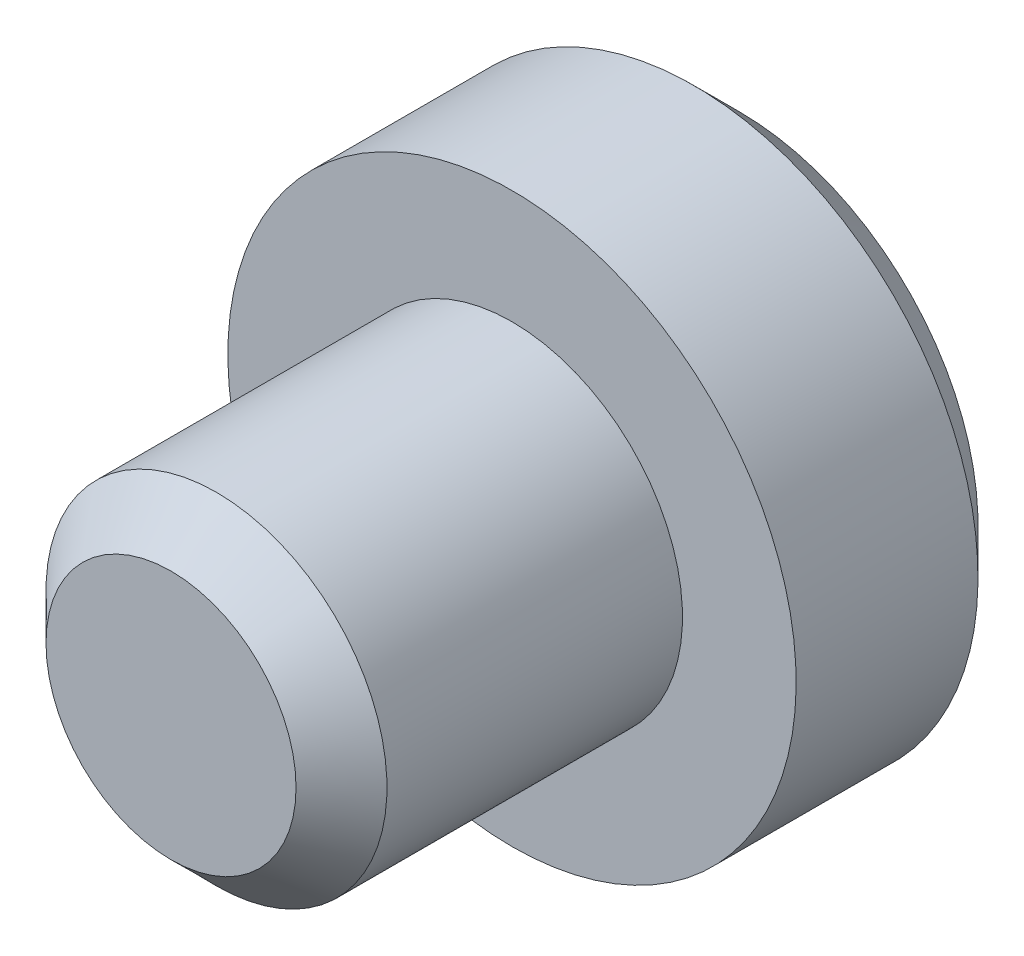
ISO-10303-21;
HEADER;
FILE_DESCRIPTION(('STEP AP214'),'2;1');
FILE_NAME('part.step','',(''),(''),'','','');
FILE_SCHEMA(('AUTOMOTIVE_DESIGN { 1 0 10303 214 1 1 1 1 }'));
ENDSEC;
DATA;
#1=APPLICATION_CONTEXT('core data for automotive mechanical design processes');
#2=APPLICATION_PROTOCOL_DEFINITION('international standard','automotive_design',2000,#1);
#3=PRODUCT_CONTEXT('',#1,'mechanical');
#4=PRODUCT('Part','Part','',(#3));
#5=PRODUCT_RELATED_PRODUCT_CATEGORY('part','',(#4));
#6=PRODUCT_DEFINITION_FORMATION('','',#4);
#7=PRODUCT_DEFINITION_CONTEXT('part definition',#1,'design');
#8=PRODUCT_DEFINITION('design','',#6,#7);
#9=PRODUCT_DEFINITION_SHAPE('','',#8);
#10=(LENGTH_UNIT() NAMED_UNIT(*) SI_UNIT(.MILLI.,.METRE.));
#11=(NAMED_UNIT(*) PLANE_ANGLE_UNIT() SI_UNIT($,.RADIAN.));
#12=(NAMED_UNIT(*) SI_UNIT($,.STERADIAN.) SOLID_ANGLE_UNIT());
#13=UNCERTAINTY_MEASURE_WITH_UNIT(LENGTH_MEASURE(1.E-05),#10,'distance_accuracy_value','');
#14=(GEOMETRIC_REPRESENTATION_CONTEXT(3) GLOBAL_UNCERTAINTY_ASSIGNED_CONTEXT((#13)) GLOBAL_UNIT_ASSIGNED_CONTEXT((#10,
#11,#12)) REPRESENTATION_CONTEXT('',''));
#15=CARTESIAN_POINT('',(0.,0.,0.));
#16=DIRECTION('',(0.,0.,1.));
#17=DIRECTION('',(1.,0.,0.));
#18=AXIS2_PLACEMENT_3D('',#15,#16,#17);
#19=CARTESIAN_POINT('',(0.,0.,0.));
#20=DIRECTION('',(0.,0.,1.));
#21=DIRECTION('',(0.,-1.,0.));
#22=AXIS2_PLACEMENT_3D('',#19,#20,#21);
#23=PLANE('',#22);
#24=DIRECTION('',(0.799545155725772,-0.600605980619117,0.));
#25=VECTOR('',#24,1.);
#26=CARTESIAN_POINT('',(-0.720727176742942,-0.959454186870927,0.));
#27=LINE('',#26,#25);
#28=CARTESIAN_POINT('',(-1.27466830980798,-0.543342157366111,0.));
#29=VERTEX_POINT('',#28);
#30=CARTESIAN_POINT('',(-0.166786043677898,-1.37556621637574,0.));
#31=VERTEX_POINT('',#30);
#32=EDGE_CURVE('E165',#29,#31,#27,.T.);
#33=ORIENTED_EDGE('',*,*,#32,.T.);
#34=DIRECTION('',(0.919912614743906,0.392123426021745,0.));
#35=VECTOR('',#34,1.);
#36=CARTESIAN_POINT('',(0.470548111226095,-1.10389513769269,0.));
#37=LINE('',#36,#35);
#38=CARTESIAN_POINT('',(1.10788226613009,-0.832224059009633,0.));
#39=VERTEX_POINT('',#38);
#40=EDGE_CURVE('E175',#31,#39,#37,.T.);
#41=ORIENTED_EDGE('',*,*,#40,.T.);
#42=DIRECTION('',(0.120367459018134,0.992729406640862,0.));
#43=VECTOR('',#42,1.);
#44=CARTESIAN_POINT('',(1.19127528796904,-0.144440950821761,0.));
#45=LINE('',#44,#43);
#46=CARTESIAN_POINT('',(1.27466830980799,0.54334215736611,0.));
#47=VERTEX_POINT('',#46);
#48=EDGE_CURVE('E173',#39,#47,#45,.T.);
#49=ORIENTED_EDGE('',*,*,#48,.T.);
#50=DIRECTION('',(-0.799545155725772,0.600605980619117,0.));
#51=VECTOR('',#50,1.);
#52=CARTESIAN_POINT('',(0.720727176742942,0.959454186870927,0.));
#53=LINE('',#52,#51);
#54=CARTESIAN_POINT('',(0.166786043677898,1.37556621637574,0.));
#55=VERTEX_POINT('',#54);
#56=EDGE_CURVE('E171',#47,#55,#53,.T.);
#57=ORIENTED_EDGE('',*,*,#56,.T.);
#58=DIRECTION('',(-0.919912614743906,-0.392123426021745,0.));
#59=VECTOR('',#58,1.);
#60=CARTESIAN_POINT('',(-0.470548111226095,1.10389513769269,0.));
#61=LINE('',#60,#59);
#62=CARTESIAN_POINT('',(-1.10788226613009,0.832224059009633,0.));
#63=VERTEX_POINT('',#62);
#64=EDGE_CURVE('E169',#55,#63,#61,.T.);
#65=ORIENTED_EDGE('',*,*,#64,.T.);
#66=DIRECTION('',(-0.120367459018134,-0.992729406640862,0.));
#67=VECTOR('',#66,1.);
#68=CARTESIAN_POINT('',(-1.19127528796903,0.144440950821761,0.));
#69=LINE('',#68,#67);
#70=EDGE_CURVE('E167',#63,#29,#69,.T.);
#71=ORIENTED_EDGE('',*,*,#70,.T.);
#72=EDGE_LOOP('',(#33,#41,#49,#57,#65,#71));
#73=FACE_BOUND('',#72,.T.);
#74=CARTESIAN_POINT('',(0.,0.,0.));
#75=DIRECTION('',(0.,0.,1.));
#76=DIRECTION('',(0.,-1.,0.));
#77=AXIS2_PLACEMENT_3D('',#74,#75,#76);
#78=CIRCLE('',#77,2.1);
#79=CARTESIAN_POINT('',(0.,-2.1,0.));
#80=VERTEX_POINT('',#79);
#81=EDGE_CURVE('E159',#80,#80,#78,.F.);
#82=ORIENTED_EDGE('',*,*,#81,.T.);
#83=EDGE_LOOP('',(#82));
#84=FACE_BOUND('',#83,.T.);
#85=ADVANCED_FACE('F32',(#73,#84),#23,.F.);
#86=CARTESIAN_POINT('',(0.,0.,5.));
#87=DIRECTION('',(0.,0.,1.));
#88=DIRECTION('',(0.,-1.,0.));
#89=AXIS2_PLACEMENT_3D('',#86,#87,#88);
#90=CYLINDRICAL_SURFACE('',#89,2.5);
#91=CARTESIAN_POINT('',(0.,0.,0.399999999999998));
#92=DIRECTION('',(0.,0.,1.));
#93=DIRECTION('',(0.,-1.,0.));
#94=AXIS2_PLACEMENT_3D('',#91,#92,#93);
#95=CIRCLE('',#94,2.5);
#96=CARTESIAN_POINT('',(0.,-2.5,0.399999999999998));
#97=VERTEX_POINT('',#96);
#98=EDGE_CURVE('E156',#97,#97,#95,.T.);
#99=ORIENTED_EDGE('',*,*,#98,.T.);
#100=EDGE_LOOP('',(#99));
#101=FACE_BOUND('',#100,.T.);
#102=CARTESIAN_POINT('',(0.,0.,2.));
#103=DIRECTION('',(0.,0.,1.));
#104=DIRECTION('',(0.,-1.,0.));
#105=AXIS2_PLACEMENT_3D('',#102,#103,#104);
#106=CIRCLE('',#105,2.5);
#107=CARTESIAN_POINT('',(0.,-2.5,2.));
#108=VERTEX_POINT('',#107);
#109=EDGE_CURVE('E147',#108,#108,#106,.T.);
#110=ORIENTED_EDGE('',*,*,#109,.F.);
#111=EDGE_LOOP('',(#110));
#112=FACE_BOUND('',#111,.T.);
#113=ADVANCED_FACE('F243',(#101,#112),#90,.T.);
#114=CARTESIAN_POINT('',(0.,2.5,2.));
#115=DIRECTION('',(0.,0.,-1.));
#116=DIRECTION('',(0.,1.,0.));
#117=AXIS2_PLACEMENT_3D('',#114,#115,#116);
#118=PLANE('',#117);
#119=CARTESIAN_POINT('',(0.,0.,2.));
#120=DIRECTION('',(0.,0.,1.));
#121=DIRECTION('',(0.,-1.,0.));
#122=AXIS2_PLACEMENT_3D('',#119,#120,#121);
#123=CIRCLE('',#122,1.5);
#124=CARTESIAN_POINT('',(0.,-1.5,2.));
#125=VERTEX_POINT('',#124);
#126=EDGE_CURVE('E134',#125,#125,#123,.T.);
#127=ORIENTED_EDGE('',*,*,#126,.F.);
#128=EDGE_LOOP('',(#127));
#129=FACE_BOUND('',#128,.T.);
#130=ORIENTED_EDGE('',*,*,#109,.T.);
#131=EDGE_LOOP('',(#130));
#132=FACE_BOUND('',#131,.T.);
#133=ADVANCED_FACE('F248',(#129,#132),#118,.F.);
#134=CARTESIAN_POINT('',(0.,0.,5.));
#135=DIRECTION('',(0.,0.,1.));
#136=DIRECTION('',(0.,-1.,0.));
#137=AXIS2_PLACEMENT_3D('',#134,#135,#136);
#138=CYLINDRICAL_SURFACE('',#137,1.5);
#139=CARTESIAN_POINT('',(0.,0.,4.6));
#140=DIRECTION('',(0.,0.,-1.));
#141=DIRECTION('',(0.,1.,0.));
#142=AXIS2_PLACEMENT_3D('',#139,#140,#141);
#143=CIRCLE('',#142,1.5);
#144=CARTESIAN_POINT('',(0.,1.5,4.6));
#145=VERTEX_POINT('',#144);
#146=EDGE_CURVE('E153',#145,#145,#143,.T.);
#147=ORIENTED_EDGE('',*,*,#146,.T.);
#148=EDGE_LOOP('',(#147));
#149=FACE_BOUND('',#148,.T.);
#150=ORIENTED_EDGE('',*,*,#126,.T.);
#151=EDGE_LOOP('',(#150));
#152=FACE_BOUND('',#151,.T.);
#153=ADVANCED_FACE('F346',(#149,#152),#138,.T.);
#154=CARTESIAN_POINT('',(0.,1.5,5.));
#155=DIRECTION('',(0.,0.,-1.));
#156=DIRECTION('',(0.,1.,0.));
#157=AXIS2_PLACEMENT_3D('',#154,#155,#156);
#158=PLANE('',#157);
#159=CARTESIAN_POINT('',(0.,0.,5.));
#160=DIRECTION('',(0.,0.,-1.));
#161=DIRECTION('',(0.,1.,0.));
#162=AXIS2_PLACEMENT_3D('',#159,#160,#161);
#163=CIRCLE('',#162,1.1);
#164=CARTESIAN_POINT('',(0.,1.1,5.));
#165=VERTEX_POINT('',#164);
#166=EDGE_CURVE('E150',#165,#165,#163,.F.);
#167=ORIENTED_EDGE('',*,*,#166,.T.);
#168=EDGE_LOOP('',(#167));
#169=FACE_BOUND('',#168,.T.);
#170=ADVANCED_FACE('F325',(#169),#158,.F.);
#171=CARTESIAN_POINT('',(-0.152887206704739,-1.26093569834443,2.));
#172=DIRECTION('',(-0.600605980619117,-0.799545155725772,0.));
#173=DIRECTION('',(0.799545155725772,-0.600605980619117,0.));
#174=AXIS2_PLACEMENT_3D('',#171,#172,#173);
#175=PLANE('',#174);
#176=DIRECTION('',(0.,0.,-1.));
#177=VECTOR('',#176,1.);
#178=CARTESIAN_POINT('',(-0.152887206704739,-1.26093569834443,2.));
#179=LINE('',#178,#177);
#180=CARTESIAN_POINT('',(-0.152887206704739,-1.26093569834443,2.));
#181=VERTEX_POINT('',#180);
#182=CARTESIAN_POINT('',(-0.152887206704739,-1.26093569834443,0.100000000000001));
#183=VERTEX_POINT('',#182);
#184=EDGE_CURVE('E132',#181,#183,#179,.T.);
#185=ORIENTED_EDGE('',*,*,#184,.T.);
#186=DIRECTION('',(-0.799545155725772,0.600605980619117,0.));
#187=VECTOR('',#186,1.);
#188=CARTESIAN_POINT('',(-0.152887206704739,-1.26093569834443,0.100000000000001));
#189=LINE('',#188,#187);
#190=CARTESIAN_POINT('',(-1.16844595065732,-0.498063644252268,0.100000000000001));
#191=VERTEX_POINT('',#190);
#192=EDGE_CURVE('E11',#183,#191,#189,.T.);
#193=ORIENTED_EDGE('',*,*,#192,.T.);
#194=DIRECTION('',(0.,0.,-1.));
#195=VECTOR('',#194,1.);
#196=CARTESIAN_POINT('',(-1.16844595065732,-0.498063644252268,2.));
#197=LINE('',#196,#195);
#198=CARTESIAN_POINT('',(-1.16844595065732,-0.498063644252268,2.));
#199=VERTEX_POINT('',#198);
#200=EDGE_CURVE('E101',#199,#191,#197,.T.);
#201=ORIENTED_EDGE('',*,*,#200,.F.);
#202=DIRECTION('',(-0.799545155725772,0.600605980619117,0.));
#203=VECTOR('',#202,1.);
#204=CARTESIAN_POINT('',(-0.152887206704739,-1.26093569834443,2.));
#205=LINE('',#204,#203);
#206=EDGE_CURVE('E105',#181,#199,#205,.T.);
#207=ORIENTED_EDGE('',*,*,#206,.F.);
#208=EDGE_LOOP('',(#185,#193,#201,#207));
#209=FACE_BOUND('',#208,.T.);
#210=ADVANCED_FACE('F103',(#209),#175,.F.);
#211=CARTESIAN_POINT('',(1.01555874395258,-0.762872054092163,2.));
#212=DIRECTION('',(0.392123426021745,-0.919912614743906,0.));
#213=DIRECTION('',(0.919912614743906,0.392123426021745,0.));
#214=AXIS2_PLACEMENT_3D('',#211,#212,#213);
#215=PLANE('',#214);
#216=DIRECTION('',(0.,0.,-1.));
#217=VECTOR('',#216,1.);
#218=CARTESIAN_POINT('',(1.01555874395258,-0.762872054092163,2.));
#219=LINE('',#218,#217);
#220=CARTESIAN_POINT('',(1.01555874395258,-0.762872054092163,2.));
#221=VERTEX_POINT('',#220);
#222=CARTESIAN_POINT('',(1.01555874395258,-0.762872054092163,0.100000000000001));
#223=VERTEX_POINT('',#222);
#224=EDGE_CURVE('E135',#221,#223,#219,.T.);
#225=ORIENTED_EDGE('',*,*,#224,.T.);
#226=DIRECTION('',(-0.919912614743906,-0.392123426021745,0.));
#227=VECTOR('',#226,1.);
#228=CARTESIAN_POINT('',(1.01555874395258,-0.762872054092163,0.100000000000001));
#229=LINE('',#228,#227);
#230=EDGE_CURVE('E162',#223,#183,#229,.T.);
#231=ORIENTED_EDGE('',*,*,#230,.T.);
#232=ORIENTED_EDGE('',*,*,#184,.F.);
#233=DIRECTION('',(-0.919912614743906,-0.392123426021745,0.));
#234=VECTOR('',#233,1.);
#235=CARTESIAN_POINT('',(1.01555874395258,-0.762872054092163,2.));
#236=LINE('',#235,#234);
#237=EDGE_CURVE('E108',#221,#181,#236,.T.);
#238=ORIENTED_EDGE('',*,*,#237,.F.);
#239=EDGE_LOOP('',(#225,#231,#232,#238));
#240=FACE_BOUND('',#239,.T.);
#241=ADVANCED_FACE('F213',(#240),#215,.F.);
#242=CARTESIAN_POINT('',(1.16844595065732,0.498063644252268,2.));
#243=DIRECTION('',(0.992729406640862,-0.120367459018134,0.));
#244=DIRECTION('',(0.120367459018134,0.992729406640862,0.));
#245=AXIS2_PLACEMENT_3D('',#242,#243,#244);
#246=PLANE('',#245);
#247=DIRECTION('',(0.,0.,-1.));
#248=VECTOR('',#247,1.);
#249=CARTESIAN_POINT('',(1.16844595065732,0.498063644252268,2.));
#250=LINE('',#249,#248);
#251=CARTESIAN_POINT('',(1.16844595065732,0.498063644252268,2.));
#252=VERTEX_POINT('',#251);
#253=CARTESIAN_POINT('',(1.16844595065732,0.498063644252268,0.100000000000001));
#254=VERTEX_POINT('',#253);
#255=EDGE_CURVE('E138',#252,#254,#250,.T.);
#256=ORIENTED_EDGE('',*,*,#255,.T.);
#257=DIRECTION('',(-0.120367459018134,-0.992729406640862,0.));
#258=VECTOR('',#257,1.);
#259=CARTESIAN_POINT('',(1.16844595065732,0.498063644252268,0.100000000000001));
#260=LINE('',#259,#258);
#261=EDGE_CURVE('E178',#254,#223,#260,.T.);
#262=ORIENTED_EDGE('',*,*,#261,.T.);
#263=ORIENTED_EDGE('',*,*,#224,.F.);
#264=DIRECTION('',(-0.120367459018134,-0.992729406640862,0.));
#265=VECTOR('',#264,1.);
#266=CARTESIAN_POINT('',(1.16844595065732,0.498063644252268,2.));
#267=LINE('',#266,#265);
#268=EDGE_CURVE('E129',#252,#221,#267,.T.);
#269=ORIENTED_EDGE('',*,*,#268,.F.);
#270=EDGE_LOOP('',(#256,#262,#263,#269));
#271=FACE_BOUND('',#270,.T.);
#272=ADVANCED_FACE('F233',(#271),#246,.F.);
#273=CARTESIAN_POINT('',(0.15288720670474,1.26093569834443,2.));
#274=DIRECTION('',(0.600605980619117,0.799545155725772,0.));
#275=DIRECTION('',(-0.799545155725772,0.600605980619117,0.));
#276=AXIS2_PLACEMENT_3D('',#273,#274,#275);
#277=PLANE('',#276);
#278=DIRECTION('',(0.,0.,-1.));
#279=VECTOR('',#278,1.);
#280=CARTESIAN_POINT('',(0.15288720670474,1.26093569834443,2.));
#281=LINE('',#280,#279);
#282=CARTESIAN_POINT('',(0.15288720670474,1.26093569834443,2.));
#283=VERTEX_POINT('',#282);
#284=CARTESIAN_POINT('',(0.15288720670474,1.26093569834443,0.100000000000001));
#285=VERTEX_POINT('',#284);
#286=EDGE_CURVE('E141',#283,#285,#281,.T.);
#287=ORIENTED_EDGE('',*,*,#286,.T.);
#288=DIRECTION('',(0.799545155725772,-0.600605980619117,0.));
#289=VECTOR('',#288,1.);
#290=CARTESIAN_POINT('',(0.15288720670474,1.26093569834443,0.100000000000001));
#291=LINE('',#290,#289);
#292=EDGE_CURVE('E180',#285,#254,#291,.T.);
#293=ORIENTED_EDGE('',*,*,#292,.T.);
#294=ORIENTED_EDGE('',*,*,#255,.F.);
#295=DIRECTION('',(0.799545155725772,-0.600605980619117,0.));
#296=VECTOR('',#295,1.);
#297=CARTESIAN_POINT('',(0.15288720670474,1.26093569834443,2.));
#298=LINE('',#297,#296);
#299=EDGE_CURVE('E126',#283,#252,#298,.T.);
#300=ORIENTED_EDGE('',*,*,#299,.F.);
#301=EDGE_LOOP('',(#287,#293,#294,#300));
#302=FACE_BOUND('',#301,.T.);
#303=ADVANCED_FACE('F209',(#302),#277,.F.);
#304=CARTESIAN_POINT('',(-1.01555874395258,0.762872054092163,2.));
#305=DIRECTION('',(-0.392123426021745,0.919912614743906,0.));
#306=DIRECTION('',(-0.919912614743906,-0.392123426021745,0.));
#307=AXIS2_PLACEMENT_3D('',#304,#305,#306);
#308=PLANE('',#307);
#309=DIRECTION('',(0.,0.,-1.));
#310=VECTOR('',#309,1.);
#311=CARTESIAN_POINT('',(-1.01555874395258,0.762872054092163,2.));
#312=LINE('',#311,#310);
#313=CARTESIAN_POINT('',(-1.01555874395258,0.762872054092163,2.));
#314=VERTEX_POINT('',#313);
#315=CARTESIAN_POINT('',(-1.01555874395258,0.762872054092163,0.100000000000001));
#316=VERTEX_POINT('',#315);
#317=EDGE_CURVE('E107',#314,#316,#312,.T.);
#318=ORIENTED_EDGE('',*,*,#317,.T.);
#319=DIRECTION('',(0.919912614743906,0.392123426021745,0.));
#320=VECTOR('',#319,1.);
#321=CARTESIAN_POINT('',(-1.01555874395258,0.762872054092163,0.100000000000001));
#322=LINE('',#321,#320);
#323=EDGE_CURVE('E182',#316,#285,#322,.T.);
#324=ORIENTED_EDGE('',*,*,#323,.T.);
#325=ORIENTED_EDGE('',*,*,#286,.F.);
#326=DIRECTION('',(0.919912614743906,0.392123426021745,0.));
#327=VECTOR('',#326,1.);
#328=CARTESIAN_POINT('',(-1.01555874395258,0.762872054092163,2.));
#329=LINE('',#328,#327);
#330=EDGE_CURVE('E116',#314,#283,#329,.T.);
#331=ORIENTED_EDGE('',*,*,#330,.F.);
#332=EDGE_LOOP('',(#318,#324,#325,#331));
#333=FACE_BOUND('',#332,.T.);
#334=ADVANCED_FACE('F206',(#333),#308,.F.);
#335=CARTESIAN_POINT('',(-1.16844595065732,-0.498063644252268,2.));
#336=DIRECTION('',(-0.992729406640862,0.120367459018134,0.));
#337=DIRECTION('',(-0.120367459018134,-0.992729406640862,0.));
#338=AXIS2_PLACEMENT_3D('',#335,#336,#337);
#339=PLANE('',#338);
#340=ORIENTED_EDGE('',*,*,#200,.T.);
#341=DIRECTION('',(0.120367459018134,0.992729406640862,0.));
#342=VECTOR('',#341,1.);
#343=CARTESIAN_POINT('',(-1.16844595065732,-0.498063644252268,0.100000000000001));
#344=LINE('',#343,#342);
#345=EDGE_CURVE('E41',#191,#316,#344,.T.);
#346=ORIENTED_EDGE('',*,*,#345,.T.);
#347=ORIENTED_EDGE('',*,*,#317,.F.);
#348=DIRECTION('',(0.120367459018134,0.992729406640862,0.));
#349=VECTOR('',#348,1.);
#350=CARTESIAN_POINT('',(-1.16844595065732,-0.498063644252268,2.));
#351=LINE('',#350,#349);
#352=EDGE_CURVE('E111',#199,#314,#351,.T.);
#353=ORIENTED_EDGE('',*,*,#352,.F.);
#354=EDGE_LOOP('',(#340,#346,#347,#353));
#355=FACE_BOUND('',#354,.T.);
#356=ADVANCED_FACE('F112',(#355),#339,.F.);
#357=CARTESIAN_POINT('',(0.,0.,2.));
#358=DIRECTION('',(0.,0.,-1.));
#359=DIRECTION('',(0.,1.,0.));
#360=AXIS2_PLACEMENT_3D('',#357,#358,#359);
#361=PLANE('',#360);
#362=ORIENTED_EDGE('',*,*,#206,.T.);
#363=ORIENTED_EDGE('',*,*,#352,.T.);
#364=ORIENTED_EDGE('',*,*,#330,.T.);
#365=ORIENTED_EDGE('',*,*,#299,.T.);
#366=ORIENTED_EDGE('',*,*,#268,.T.);
#367=ORIENTED_EDGE('',*,*,#237,.T.);
#368=EDGE_LOOP('',(#362,#363,#364,#365,#366,#367));
#369=FACE_BOUND('',#368,.T.);
#370=ADVANCED_FACE('F118',(#369),#361,.T.);
#371=CARTESIAN_POINT('',(0.,0.,5.));
#372=DIRECTION('',(0.,0.,-1.));
#373=DIRECTION('',(0.,1.,0.));
#374=AXIS2_PLACEMENT_3D('',#371,#372,#373);
#375=CONICAL_SURFACE('',#374,1.1,0.785398163397447);
#376=ORIENTED_EDGE('',*,*,#146,.F.);
#377=EDGE_LOOP('',(#376));
#378=FACE_BOUND('',#377,.T.);
#379=ORIENTED_EDGE('',*,*,#166,.F.);
#380=EDGE_LOOP('',(#379));
#381=FACE_BOUND('',#380,.T.);
#382=ADVANCED_FACE('F253',(#378,#381),#375,.T.);
#383=CARTESIAN_POINT('',(0.,0.,0.399999999999998));
#384=DIRECTION('',(0.,0.,1.));
#385=DIRECTION('',(0.,-1.,0.));
#386=AXIS2_PLACEMENT_3D('',#383,#384,#385);
#387=CONICAL_SURFACE('',#386,2.5,0.78539816339745);
#388=ORIENTED_EDGE('',*,*,#81,.F.);
#389=EDGE_LOOP('',(#388));
#390=FACE_BOUND('',#389,.T.);
#391=ORIENTED_EDGE('',*,*,#98,.F.);
#392=EDGE_LOOP('',(#391));
#393=FACE_BOUND('',#392,.T.);
#394=ADVANCED_FACE('F256',(#390,#393),#387,.T.);
#395=CARTESIAN_POINT('',(-1.01555874395258,0.762872054092163,0.100000000000001));
#396=DIRECTION('',(-0.277273133602077,0.650476447984463,0.707106781186548));
#397=DIRECTION('',(0.919912614743906,0.392123426021745,0.));
#398=AXIS2_PLACEMENT_3D('',#395,#396,#397);
#399=PLANE('',#398);
#400=DIRECTION('',(0.604399326861942,-0.454015445901791,0.654653670707977));
#401=VECTOR('',#400,1.);
#402=CARTESIAN_POINT('',(-1.01555874395258,0.762872054092163,0.100000000000001));
#403=LINE('',#402,#401);
#404=EDGE_CURVE('E123',#63,#316,#403,.T.);
#405=ORIENTED_EDGE('',*,*,#404,.F.);
#406=ORIENTED_EDGE('',*,*,#64,.F.);
#407=DIRECTION('',(-0.090989246430495,-0.750432894043553,0.654653670707977));
#408=VECTOR('',#407,1.);
#409=CARTESIAN_POINT('',(0.15288720670474,1.26093569834443,0.100000000000001));
#410=LINE('',#409,#408);
#411=EDGE_CURVE('E36',#285,#55,#410,.F.);
#412=ORIENTED_EDGE('',*,*,#411,.F.);
#413=ORIENTED_EDGE('',*,*,#323,.F.);
#414=EDGE_LOOP('',(#405,#406,#412,#413));
#415=FACE_BOUND('',#414,.T.);
#416=ADVANCED_FACE('F34',(#415),#399,.F.);
#417=CARTESIAN_POINT('',(0.15288720670474,1.26093569834443,0.100000000000001));
#418=DIRECTION('',(0.424692561716974,0.565363801478548,0.707106781186547));
#419=DIRECTION('',(0.799545155725772,-0.600605980619117,0.));
#420=AXIS2_PLACEMENT_3D('',#417,#418,#419);
#421=PLANE('',#420);
#422=ORIENTED_EDGE('',*,*,#411,.T.);
#423=ORIENTED_EDGE('',*,*,#56,.F.);
#424=DIRECTION('',(-0.695388573292441,-0.296417448141762,0.654653670707978));
#425=VECTOR('',#424,1.);
#426=CARTESIAN_POINT('',(1.16844595065732,0.498063644252268,0.100000000000001));
#427=LINE('',#426,#425);
#428=EDGE_CURVE('E192',#254,#47,#427,.F.);
#429=ORIENTED_EDGE('',*,*,#428,.F.);
#430=ORIENTED_EDGE('',*,*,#292,.F.);
#431=EDGE_LOOP('',(#422,#423,#429,#430));
#432=FACE_BOUND('',#431,.T.);
#433=ADVANCED_FACE('F229',(#432),#421,.F.);
#434=CARTESIAN_POINT('',(-1.16844595065732,-0.498063644252268,0.100000000000001));
#435=DIRECTION('',(-0.701965695319052,0.0851126465059164,0.707106781186547));
#436=DIRECTION('',(0.120367459018134,0.992729406640862,0.));
#437=AXIS2_PLACEMENT_3D('',#434,#435,#436);
#438=PLANE('',#437);
#439=ORIENTED_EDGE('',*,*,#404,.T.);
#440=ORIENTED_EDGE('',*,*,#345,.F.);
#441=DIRECTION('',(0.69538857329244,0.296417448141765,0.654653670707977));
#442=VECTOR('',#441,1.);
#443=CARTESIAN_POINT('',(-1.16844595065732,-0.498063644252268,0.100000000000001));
#444=LINE('',#443,#442);
#445=EDGE_CURVE('E189',#29,#191,#444,.T.);
#446=ORIENTED_EDGE('',*,*,#445,.F.);
#447=ORIENTED_EDGE('',*,*,#70,.F.);
#448=EDGE_LOOP('',(#439,#440,#446,#447));
#449=FACE_BOUND('',#448,.T.);
#450=ADVANCED_FACE('F198',(#449),#438,.F.);
#451=CARTESIAN_POINT('',(1.16844595065732,0.498063644252268,0.100000000000001));
#452=DIRECTION('',(0.701965695319051,-0.0851126465059164,0.707106781186547));
#453=DIRECTION('',(-0.120367459018134,-0.992729406640862,0.));
#454=AXIS2_PLACEMENT_3D('',#451,#452,#453);
#455=PLANE('',#454);
#456=ORIENTED_EDGE('',*,*,#428,.T.);
#457=ORIENTED_EDGE('',*,*,#48,.F.);
#458=DIRECTION('',(-0.604399326861942,0.454015445901792,0.654653670707977));
#459=VECTOR('',#458,1.);
#460=CARTESIAN_POINT('',(1.01555874395258,-0.762872054092163,0.100000000000001));
#461=LINE('',#460,#459);
#462=EDGE_CURVE('E187',#223,#39,#461,.F.);
#463=ORIENTED_EDGE('',*,*,#462,.F.);
#464=ORIENTED_EDGE('',*,*,#261,.F.);
#465=EDGE_LOOP('',(#456,#457,#463,#464));
#466=FACE_BOUND('',#465,.T.);
#467=ADVANCED_FACE('F232',(#466),#455,.F.);
#468=CARTESIAN_POINT('',(-0.152887206704739,-1.26093569834443,0.100000000000001));
#469=DIRECTION('',(-0.424692561716974,-0.565363801478547,0.707106781186548));
#470=DIRECTION('',(-0.799545155725772,0.600605980619117,0.));
#471=AXIS2_PLACEMENT_3D('',#468,#469,#470);
#472=PLANE('',#471);
#473=ORIENTED_EDGE('',*,*,#445,.T.);
#474=ORIENTED_EDGE('',*,*,#192,.F.);
#475=DIRECTION('',(-0.0909892464304957,-0.750432894043554,-0.654653670707976));
#476=VECTOR('',#475,1.);
#477=CARTESIAN_POINT('',(-0.109205147646243,-0.900668355960308,0.414285714285714));
#478=LINE('',#477,#476);
#479=EDGE_CURVE('E185',#31,#183,#478,.F.);
#480=ORIENTED_EDGE('',*,*,#479,.F.);
#481=ORIENTED_EDGE('',*,*,#32,.F.);
#482=EDGE_LOOP('',(#473,#474,#480,#481));
#483=FACE_BOUND('',#482,.T.);
#484=ADVANCED_FACE('F223',(#483),#472,.F.);
#485=CARTESIAN_POINT('',(1.01555874395258,-0.762872054092163,0.100000000000001));
#486=DIRECTION('',(0.277273133602077,-0.650476447984462,0.707106781186549));
#487=DIRECTION('',(-0.919912614743906,-0.392123426021745,0.));
#488=AXIS2_PLACEMENT_3D('',#485,#486,#487);
#489=PLANE('',#488);
#490=ORIENTED_EDGE('',*,*,#462,.T.);
#491=ORIENTED_EDGE('',*,*,#40,.F.);
#492=ORIENTED_EDGE('',*,*,#479,.T.);
#493=ORIENTED_EDGE('',*,*,#230,.F.);
#494=EDGE_LOOP('',(#490,#491,#492,#493));
#495=FACE_BOUND('',#494,.T.);
#496=ADVANCED_FACE('F217',(#495),#489,.F.);
#497=CLOSED_SHELL('',(#85,#113,#133,#153,#170,#210,#241,#272,#303,#334,#356,#370,#382,#394,#416,
#433,#450,#467,#484,#496));
#498=MANIFOLD_SOLID_BREP('B2',#497);
#499=ADVANCED_BREP_SHAPE_REPRESENTATION('',(#18,#498),#14);
#500=SHAPE_DEFINITION_REPRESENTATION(#9,#499);
ENDSEC;
END-ISO-10303-21;
